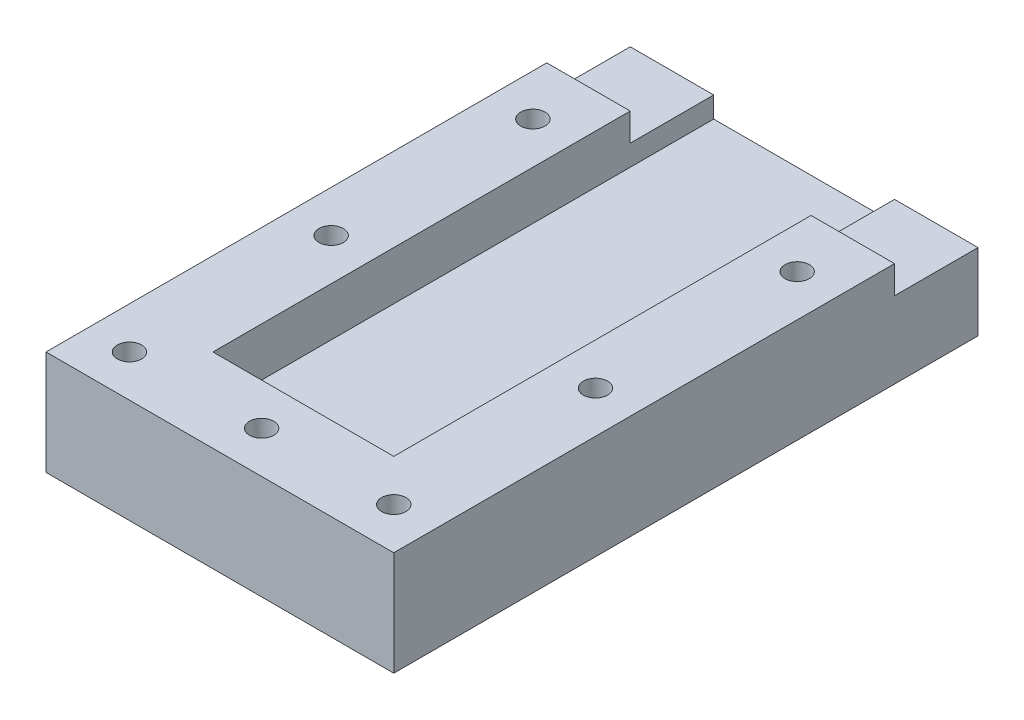
ISO-10303-21;
HEADER;
FILE_DESCRIPTION(('STEP AP214'),'2;1');
FILE_NAME('part.step','',(''),(''),'','','');
FILE_SCHEMA(('AUTOMOTIVE_DESIGN { 1 0 10303 214 1 1 1 1 }'));
ENDSEC;
DATA;
#1=APPLICATION_CONTEXT('core data for automotive mechanical design processes');
#2=APPLICATION_PROTOCOL_DEFINITION('international standard','automotive_design',2000,#1);
#3=PRODUCT_CONTEXT('',#1,'mechanical');
#4=PRODUCT('Part','Part','',(#3));
#5=PRODUCT_RELATED_PRODUCT_CATEGORY('part','',(#4));
#6=PRODUCT_DEFINITION_FORMATION('','',#4);
#7=PRODUCT_DEFINITION_CONTEXT('part definition',#1,'design');
#8=PRODUCT_DEFINITION('design','',#6,#7);
#9=PRODUCT_DEFINITION_SHAPE('','',#8);
#10=(LENGTH_UNIT() NAMED_UNIT(*) SI_UNIT(.MILLI.,.METRE.));
#11=(NAMED_UNIT(*) PLANE_ANGLE_UNIT() SI_UNIT($,.RADIAN.));
#12=(NAMED_UNIT(*) SI_UNIT($,.STERADIAN.) SOLID_ANGLE_UNIT());
#13=UNCERTAINTY_MEASURE_WITH_UNIT(LENGTH_MEASURE(1.E-05),#10,'distance_accuracy_value','');
#14=(GEOMETRIC_REPRESENTATION_CONTEXT(3) GLOBAL_UNCERTAINTY_ASSIGNED_CONTEXT((#13)) GLOBAL_UNIT_ASSIGNED_CONTEXT((#10,
#11,#12)) REPRESENTATION_CONTEXT('',''));
#15=CARTESIAN_POINT('',(0.,0.,0.));
#16=DIRECTION('',(0.,0.,1.));
#17=DIRECTION('',(1.,0.,0.));
#18=AXIS2_PLACEMENT_3D('',#15,#16,#17);
#19=CARTESIAN_POINT('',(0.,0.,0.));
#20=DIRECTION('',(0.,0.,1.));
#21=DIRECTION('',(1.,0.,0.));
#22=AXIS2_PLACEMENT_3D('',#19,#20,#21);
#23=PLANE('',#22);
#24=DIRECTION('',(0.,-1.,0.));
#25=VECTOR('',#24,1.);
#26=CARTESIAN_POINT('',(-25.,15.,0.));
#27=LINE('',#26,#25);
#28=CARTESIAN_POINT('',(-25.,-4.,0.));
#29=VERTEX_POINT('',#28);
#30=CARTESIAN_POINT('',(-25.,-15.,0.));
#31=VERTEX_POINT('',#30);
#32=EDGE_CURVE('E206',#29,#31,#27,.T.);
#33=ORIENTED_EDGE('',*,*,#32,.F.);
#34=DIRECTION('',(1.,0.,0.));
#35=VECTOR('',#34,1.);
#36=CARTESIAN_POINT('',(-25.,-4.,0.));
#37=LINE('',#36,#35);
#38=CARTESIAN_POINT('',(-13.,-4.,0.));
#39=VERTEX_POINT('',#38);
#40=EDGE_CURVE('E157',#29,#39,#37,.T.);
#41=ORIENTED_EDGE('',*,*,#40,.T.);
#42=DIRECTION('',(0.,1.,0.));
#43=VECTOR('',#42,1.);
#44=CARTESIAN_POINT('',(-13.,7.,0.));
#45=LINE('',#44,#43);
#46=CARTESIAN_POINT('',(-13.,-7.,0.));
#47=VERTEX_POINT('',#46);
#48=EDGE_CURVE('E179',#47,#39,#45,.T.);
#49=ORIENTED_EDGE('',*,*,#48,.F.);
#50=DIRECTION('',(-1.,0.,0.));
#51=VECTOR('',#50,1.);
#52=CARTESIAN_POINT('',(-13.,-7.,0.));
#53=LINE('',#52,#51);
#54=CARTESIAN_POINT('',(13.,-7.,0.));
#55=VERTEX_POINT('',#54);
#56=EDGE_CURVE('E187',#55,#47,#53,.T.);
#57=ORIENTED_EDGE('',*,*,#56,.F.);
#58=DIRECTION('',(0.,-1.,0.));
#59=VECTOR('',#58,1.);
#60=CARTESIAN_POINT('',(13.,7.,0.));
#61=LINE('',#60,#59);
#62=CARTESIAN_POINT('',(13.,-4.,0.));
#63=VERTEX_POINT('',#62);
#64=EDGE_CURVE('E174',#63,#55,#61,.T.);
#65=ORIENTED_EDGE('',*,*,#64,.F.);
#66=DIRECTION('',(-1.,0.,0.));
#67=VECTOR('',#66,1.);
#68=CARTESIAN_POINT('',(25.,-4.,0.));
#69=LINE('',#68,#67);
#70=CARTESIAN_POINT('',(25.,-4.,0.));
#71=VERTEX_POINT('',#70);
#72=EDGE_CURVE('E58',#71,#63,#69,.T.);
#73=ORIENTED_EDGE('',*,*,#72,.F.);
#74=DIRECTION('',(0.,1.,0.));
#75=VECTOR('',#74,1.);
#76=CARTESIAN_POINT('',(25.,15.,0.));
#77=LINE('',#76,#75);
#78=CARTESIAN_POINT('',(25.,-15.,0.));
#79=VERTEX_POINT('',#78);
#80=EDGE_CURVE('E194',#79,#71,#77,.T.);
#81=ORIENTED_EDGE('',*,*,#80,.F.);
#82=DIRECTION('',(1.,0.,0.));
#83=VECTOR('',#82,1.);
#84=CARTESIAN_POINT('',(-25.,-15.,0.));
#85=LINE('',#84,#83);
#86=EDGE_CURVE('E200',#31,#79,#85,.T.);
#87=ORIENTED_EDGE('',*,*,#86,.F.);
#88=EDGE_LOOP('',(#33,#41,#49,#57,#65,#73,#81,#87));
#89=FACE_BOUND('',#88,.T.);
#90=ADVANCED_FACE('F34',(#89),#23,.F.);
#91=CARTESIAN_POINT('',(25.,15.,84.));
#92=DIRECTION('',(-1.,0.,0.));
#93=DIRECTION('',(0.,-1.,0.));
#94=AXIS2_PLACEMENT_3D('',#91,#92,#93);
#95=PLANE('',#94);
#96=DIRECTION('',(0.,1.,0.));
#97=VECTOR('',#96,1.);
#98=CARTESIAN_POINT('',(25.,4.,12.));
#99=LINE('',#98,#97);
#100=CARTESIAN_POINT('',(25.,-4.,12.));
#101=VERTEX_POINT('',#100);
#102=CARTESIAN_POINT('',(25.,0.,12.));
#103=VERTEX_POINT('',#102);
#104=EDGE_CURVE('E165',#101,#103,#99,.T.);
#105=ORIENTED_EDGE('',*,*,#104,.T.);
#106=DIRECTION('',(0.,0.,1.));
#107=VECTOR('',#106,1.);
#108=CARTESIAN_POINT('',(25.,0.,84.));
#109=LINE('',#108,#107);
#110=CARTESIAN_POINT('',(25.,0.,84.));
#111=VERTEX_POINT('',#110);
#112=EDGE_CURVE('E440',#103,#111,#109,.T.);
#113=ORIENTED_EDGE('',*,*,#112,.T.);
#114=DIRECTION('',(0.,1.,0.));
#115=VECTOR('',#114,1.);
#116=CARTESIAN_POINT('',(25.,15.,84.));
#117=LINE('',#116,#115);
#118=CARTESIAN_POINT('',(25.,-15.,84.));
#119=VERTEX_POINT('',#118);
#120=EDGE_CURVE('E197',#119,#111,#117,.T.);
#121=ORIENTED_EDGE('',*,*,#120,.F.);
#122=DIRECTION('',(0.,0.,-1.));
#123=VECTOR('',#122,1.);
#124=CARTESIAN_POINT('',(25.,-15.,84.));
#125=LINE('',#124,#123);
#126=EDGE_CURVE('E43',#119,#79,#125,.T.);
#127=ORIENTED_EDGE('',*,*,#126,.T.);
#128=ORIENTED_EDGE('',*,*,#80,.T.);
#129=DIRECTION('',(0.,0.,1.));
#130=VECTOR('',#129,1.);
#131=CARTESIAN_POINT('',(25.,-4.,0.));
#132=LINE('',#131,#130);
#133=EDGE_CURVE('E162',#71,#101,#132,.T.);
#134=ORIENTED_EDGE('',*,*,#133,.T.);
#135=EDGE_LOOP('',(#105,#113,#121,#127,#128,#134));
#136=FACE_BOUND('',#135,.T.);
#137=ADVANCED_FACE('F36',(#136),#95,.F.);
#138=CARTESIAN_POINT('',(-25.,15.,84.));
#139=DIRECTION('',(1.,0.,0.));
#140=DIRECTION('',(0.,0.,-1.));
#141=AXIS2_PLACEMENT_3D('',#138,#139,#140);
#142=PLANE('',#141);
#143=DIRECTION('',(0.,-1.,0.));
#144=VECTOR('',#143,1.);
#145=CARTESIAN_POINT('',(-25.,15.,84.));
#146=LINE('',#145,#144);
#147=CARTESIAN_POINT('',(-25.,0.,84.));
#148=VERTEX_POINT('',#147);
#149=CARTESIAN_POINT('',(-25.,-15.,84.));
#150=VERTEX_POINT('',#149);
#151=EDGE_CURVE('E139',#148,#150,#146,.T.);
#152=ORIENTED_EDGE('',*,*,#151,.F.);
#153=DIRECTION('',(0.,0.,-1.));
#154=VECTOR('',#153,1.);
#155=CARTESIAN_POINT('',(-25.,0.,84.));
#156=LINE('',#155,#154);
#157=CARTESIAN_POINT('',(-25.,0.,12.));
#158=VERTEX_POINT('',#157);
#159=EDGE_CURVE('E125',#148,#158,#156,.T.);
#160=ORIENTED_EDGE('',*,*,#159,.T.);
#161=DIRECTION('',(0.,-1.,0.));
#162=VECTOR('',#161,1.);
#163=CARTESIAN_POINT('',(-25.,4.,12.));
#164=LINE('',#163,#162);
#165=CARTESIAN_POINT('',(-25.,-4.,12.));
#166=VERTEX_POINT('',#165);
#167=EDGE_CURVE('E136',#158,#166,#164,.T.);
#168=ORIENTED_EDGE('',*,*,#167,.T.);
#169=DIRECTION('',(0.,0.,-1.));
#170=VECTOR('',#169,1.);
#171=CARTESIAN_POINT('',(-25.,-4.,0.));
#172=LINE('',#171,#170);
#173=EDGE_CURVE('E146',#166,#29,#172,.T.);
#174=ORIENTED_EDGE('',*,*,#173,.T.);
#175=ORIENTED_EDGE('',*,*,#32,.T.);
#176=DIRECTION('',(0.,0.,-1.));
#177=VECTOR('',#176,1.);
#178=CARTESIAN_POINT('',(-25.,-15.,84.));
#179=LINE('',#178,#177);
#180=EDGE_CURVE('E12',#150,#31,#179,.T.);
#181=ORIENTED_EDGE('',*,*,#180,.F.);
#182=EDGE_LOOP('',(#152,#160,#168,#174,#175,#181));
#183=FACE_BOUND('',#182,.T.);
#184=ADVANCED_FACE('F134',(#183),#142,.F.);
#185=CARTESIAN_POINT('',(-25.,-15.,84.));
#186=DIRECTION('',(0.,1.,0.));
#187=DIRECTION('',(0.,0.,1.));
#188=AXIS2_PLACEMENT_3D('',#185,#186,#187);
#189=PLANE('',#188);
#190=CARTESIAN_POINT('',(19.,-15.,49.));
#191=DIRECTION('',(0.,1.,0.));
#192=DIRECTION('',(0.,0.,1.));
#193=AXIS2_PLACEMENT_3D('',#190,#191,#192);
#194=CIRCLE('',#193,1.75);
#195=CARTESIAN_POINT('',(19.,-15.,50.75));
#196=VERTEX_POINT('',#195);
#197=EDGE_CURVE('E450',#196,#196,#194,.T.);
#198=ORIENTED_EDGE('',*,*,#197,.T.);
#199=EDGE_LOOP('',(#198));
#200=FACE_BOUND('',#199,.T.);
#201=CARTESIAN_POINT('',(19.,-15.,78.));
#202=DIRECTION('',(0.,1.,0.));
#203=DIRECTION('',(0.,0.,1.));
#204=AXIS2_PLACEMENT_3D('',#201,#202,#203);
#205=CIRCLE('',#204,1.75);
#206=CARTESIAN_POINT('',(19.,-15.,79.75));
#207=VERTEX_POINT('',#206);
#208=EDGE_CURVE('E453',#207,#207,#205,.T.);
#209=ORIENTED_EDGE('',*,*,#208,.T.);
#210=EDGE_LOOP('',(#209));
#211=FACE_BOUND('',#210,.T.);
#212=CARTESIAN_POINT('',(0.,-15.,78.));
#213=DIRECTION('',(0.,1.,0.));
#214=DIRECTION('',(0.,0.,1.));
#215=AXIS2_PLACEMENT_3D('',#212,#213,#214);
#216=CIRCLE('',#215,1.75);
#217=CARTESIAN_POINT('',(0.,-15.,79.75));
#218=VERTEX_POINT('',#217);
#219=EDGE_CURVE('E456',#218,#218,#216,.T.);
#220=ORIENTED_EDGE('',*,*,#219,.T.);
#221=EDGE_LOOP('',(#220));
#222=FACE_BOUND('',#221,.T.);
#223=CARTESIAN_POINT('',(-19.,-15.,78.));
#224=DIRECTION('',(0.,1.,0.));
#225=DIRECTION('',(0.,0.,1.));
#226=AXIS2_PLACEMENT_3D('',#223,#224,#225);
#227=CIRCLE('',#226,1.75);
#228=CARTESIAN_POINT('',(-19.,-15.,79.75));
#229=VERTEX_POINT('',#228);
#230=EDGE_CURVE('E447',#229,#229,#227,.T.);
#231=ORIENTED_EDGE('',*,*,#230,.T.);
#232=EDGE_LOOP('',(#231));
#233=FACE_BOUND('',#232,.T.);
#234=CARTESIAN_POINT('',(-19.,-15.,49.));
#235=DIRECTION('',(0.,1.,0.));
#236=DIRECTION('',(0.,0.,1.));
#237=AXIS2_PLACEMENT_3D('',#234,#235,#236);
#238=CIRCLE('',#237,1.75);
#239=CARTESIAN_POINT('',(-19.,-15.,50.75));
#240=VERTEX_POINT('',#239);
#241=EDGE_CURVE('E444',#240,#240,#238,.T.);
#242=ORIENTED_EDGE('',*,*,#241,.T.);
#243=EDGE_LOOP('',(#242));
#244=FACE_BOUND('',#243,.T.);
#245=CARTESIAN_POINT('',(-19.,-15.,20.));
#246=DIRECTION('',(0.,1.,0.));
#247=DIRECTION('',(0.,0.,1.));
#248=AXIS2_PLACEMENT_3D('',#245,#246,#247);
#249=CIRCLE('',#248,1.75);
#250=CARTESIAN_POINT('',(-19.,-15.,21.75));
#251=VERTEX_POINT('',#250);
#252=EDGE_CURVE('E443',#251,#251,#249,.T.);
#253=ORIENTED_EDGE('',*,*,#252,.T.);
#254=EDGE_LOOP('',(#253));
#255=FACE_BOUND('',#254,.T.);
#256=CARTESIAN_POINT('',(19.,-15.,20.));
#257=DIRECTION('',(0.,1.,0.));
#258=DIRECTION('',(0.,0.,1.));
#259=AXIS2_PLACEMENT_3D('',#256,#257,#258);
#260=CIRCLE('',#259,1.75);
#261=CARTESIAN_POINT('',(19.,-15.,21.75));
#262=VERTEX_POINT('',#261);
#263=EDGE_CURVE('E153',#262,#262,#260,.T.);
#264=ORIENTED_EDGE('',*,*,#263,.T.);
#265=EDGE_LOOP('',(#264));
#266=FACE_BOUND('',#265,.T.);
#267=ORIENTED_EDGE('',*,*,#86,.T.);
#268=ORIENTED_EDGE('',*,*,#126,.F.);
#269=DIRECTION('',(1.,0.,0.));
#270=VECTOR('',#269,1.);
#271=CARTESIAN_POINT('',(-25.,-15.,84.));
#272=LINE('',#271,#270);
#273=EDGE_CURVE('E202',#150,#119,#272,.T.);
#274=ORIENTED_EDGE('',*,*,#273,.F.);
#275=ORIENTED_EDGE('',*,*,#180,.T.);
#276=EDGE_LOOP('',(#267,#268,#274,#275));
#277=FACE_BOUND('',#276,.T.);
#278=ADVANCED_FACE('F265',(#200,#211,#222,#233,#244,#255,#266,#277),#189,.F.);
#279=CARTESIAN_POINT('',(0.,0.,84.));
#280=DIRECTION('',(0.,0.,1.));
#281=DIRECTION('',(1.,0.,0.));
#282=AXIS2_PLACEMENT_3D('',#279,#280,#281);
#283=PLANE('',#282);
#284=DIRECTION('',(1.,0.,0.));
#285=VECTOR('',#284,1.);
#286=CARTESIAN_POINT('',(0.,0.,84.));
#287=LINE('',#286,#285);
#288=EDGE_CURVE('E237',#148,#111,#287,.T.);
#289=ORIENTED_EDGE('',*,*,#288,.F.);
#290=ORIENTED_EDGE('',*,*,#151,.T.);
#291=ORIENTED_EDGE('',*,*,#273,.T.);
#292=ORIENTED_EDGE('',*,*,#120,.T.);
#293=EDGE_LOOP('',(#289,#290,#291,#292));
#294=FACE_BOUND('',#293,.T.);
#295=ADVANCED_FACE('F263',(#294),#283,.T.);
#296=CARTESIAN_POINT('',(13.,7.,72.));
#297=DIRECTION('',(1.,0.,0.));
#298=DIRECTION('',(0.,1.,0.));
#299=AXIS2_PLACEMENT_3D('',#296,#297,#298);
#300=PLANE('',#299);
#301=DIRECTION('',(0.,-1.,0.));
#302=VECTOR('',#301,1.);
#303=CARTESIAN_POINT('',(13.,7.,72.));
#304=LINE('',#303,#302);
#305=CARTESIAN_POINT('',(13.,0.,72.));
#306=VERTEX_POINT('',#305);
#307=CARTESIAN_POINT('',(13.,-7.,72.));
#308=VERTEX_POINT('',#307);
#309=EDGE_CURVE('E176',#306,#308,#304,.T.);
#310=ORIENTED_EDGE('',*,*,#309,.F.);
#311=DIRECTION('',(0.,0.,-1.));
#312=VECTOR('',#311,1.);
#313=CARTESIAN_POINT('',(13.,0.,72.));
#314=LINE('',#313,#312);
#315=CARTESIAN_POINT('',(13.,0.,12.));
#316=VERTEX_POINT('',#315);
#317=EDGE_CURVE('E236',#306,#316,#314,.T.);
#318=ORIENTED_EDGE('',*,*,#317,.T.);
#319=DIRECTION('',(0.,1.,0.));
#320=VECTOR('',#319,1.);
#321=CARTESIAN_POINT('',(13.,4.,12.));
#322=LINE('',#321,#320);
#323=CARTESIAN_POINT('',(13.,-4.,12.));
#324=VERTEX_POINT('',#323);
#325=EDGE_CURVE('E166',#324,#316,#322,.T.);
#326=ORIENTED_EDGE('',*,*,#325,.F.);
#327=DIRECTION('',(0.,0.,1.));
#328=VECTOR('',#327,1.);
#329=CARTESIAN_POINT('',(13.,-4.,0.));
#330=LINE('',#329,#328);
#331=EDGE_CURVE('E160',#63,#324,#330,.T.);
#332=ORIENTED_EDGE('',*,*,#331,.F.);
#333=ORIENTED_EDGE('',*,*,#64,.T.);
#334=DIRECTION('',(0.,0.,-1.));
#335=VECTOR('',#334,1.);
#336=CARTESIAN_POINT('',(13.,-7.,72.));
#337=LINE('',#336,#335);
#338=EDGE_CURVE('E185',#308,#55,#337,.T.);
#339=ORIENTED_EDGE('',*,*,#338,.F.);
#340=EDGE_LOOP('',(#310,#318,#326,#332,#333,#339));
#341=FACE_BOUND('',#340,.T.);
#342=ADVANCED_FACE('F226',(#341),#300,.F.);
#343=CARTESIAN_POINT('',(-13.,7.,72.));
#344=DIRECTION('',(-1.,0.,0.));
#345=DIRECTION('',(0.,-1.,0.));
#346=AXIS2_PLACEMENT_3D('',#343,#344,#345);
#347=PLANE('',#346);
#348=DIRECTION('',(0.,-1.,0.));
#349=VECTOR('',#348,1.);
#350=CARTESIAN_POINT('',(-13.,4.,12.));
#351=LINE('',#350,#349);
#352=CARTESIAN_POINT('',(-13.,0.,12.));
#353=VERTEX_POINT('',#352);
#354=CARTESIAN_POINT('',(-13.,-4.,12.));
#355=VERTEX_POINT('',#354);
#356=EDGE_CURVE('E150',#353,#355,#351,.T.);
#357=ORIENTED_EDGE('',*,*,#356,.F.);
#358=DIRECTION('',(0.,0.,1.));
#359=VECTOR('',#358,1.);
#360=CARTESIAN_POINT('',(-13.,0.,72.));
#361=LINE('',#360,#359);
#362=CARTESIAN_POINT('',(-13.,0.,72.));
#363=VERTEX_POINT('',#362);
#364=EDGE_CURVE('E50',#353,#363,#361,.T.);
#365=ORIENTED_EDGE('',*,*,#364,.T.);
#366=DIRECTION('',(0.,1.,0.));
#367=VECTOR('',#366,1.);
#368=CARTESIAN_POINT('',(-13.,7.,72.));
#369=LINE('',#368,#367);
#370=CARTESIAN_POINT('',(-13.,-7.,72.));
#371=VERTEX_POINT('',#370);
#372=EDGE_CURVE('E182',#371,#363,#369,.T.);
#373=ORIENTED_EDGE('',*,*,#372,.F.);
#374=DIRECTION('',(0.,0.,-1.));
#375=VECTOR('',#374,1.);
#376=CARTESIAN_POINT('',(-13.,-7.,72.));
#377=LINE('',#376,#375);
#378=EDGE_CURVE('E192',#371,#47,#377,.T.);
#379=ORIENTED_EDGE('',*,*,#378,.T.);
#380=ORIENTED_EDGE('',*,*,#48,.T.);
#381=DIRECTION('',(0.,0.,-1.));
#382=VECTOR('',#381,1.);
#383=CARTESIAN_POINT('',(-13.,-4.,0.));
#384=LINE('',#383,#382);
#385=EDGE_CURVE('E147',#355,#39,#384,.T.);
#386=ORIENTED_EDGE('',*,*,#385,.F.);
#387=EDGE_LOOP('',(#357,#365,#373,#379,#380,#386));
#388=FACE_BOUND('',#387,.T.);
#389=ADVANCED_FACE('F290',(#388),#347,.F.);
#390=CARTESIAN_POINT('',(-13.,-7.,72.));
#391=DIRECTION('',(0.,-1.,0.));
#392=DIRECTION('',(1.,0.,0.));
#393=AXIS2_PLACEMENT_3D('',#390,#391,#392);
#394=PLANE('',#393);
#395=ORIENTED_EDGE('',*,*,#56,.T.);
#396=ORIENTED_EDGE('',*,*,#378,.F.);
#397=DIRECTION('',(-1.,0.,0.));
#398=VECTOR('',#397,1.);
#399=CARTESIAN_POINT('',(-13.,-7.,72.));
#400=LINE('',#399,#398);
#401=EDGE_CURVE('E178',#308,#371,#400,.T.);
#402=ORIENTED_EDGE('',*,*,#401,.F.);
#403=ORIENTED_EDGE('',*,*,#338,.T.);
#404=EDGE_LOOP('',(#395,#396,#402,#403));
#405=FACE_BOUND('',#404,.T.);
#406=ADVANCED_FACE('F230',(#405),#394,.F.);
#407=CARTESIAN_POINT('',(0.,0.,72.));
#408=DIRECTION('',(0.,0.,1.));
#409=DIRECTION('',(1.,0.,0.));
#410=AXIS2_PLACEMENT_3D('',#407,#408,#409);
#411=PLANE('',#410);
#412=ORIENTED_EDGE('',*,*,#372,.T.);
#413=DIRECTION('',(1.,0.,0.));
#414=VECTOR('',#413,1.);
#415=CARTESIAN_POINT('',(0.,0.,72.));
#416=LINE('',#415,#414);
#417=EDGE_CURVE('E140',#363,#306,#416,.T.);
#418=ORIENTED_EDGE('',*,*,#417,.T.);
#419=ORIENTED_EDGE('',*,*,#309,.T.);
#420=ORIENTED_EDGE('',*,*,#401,.T.);
#421=EDGE_LOOP('',(#412,#418,#419,#420));
#422=FACE_BOUND('',#421,.T.);
#423=ADVANCED_FACE('F233',(#422),#411,.F.);
#424=CARTESIAN_POINT('',(25.,4.,12.));
#425=DIRECTION('',(0.,0.,1.));
#426=DIRECTION('',(0.,-1.,0.));
#427=AXIS2_PLACEMENT_3D('',#424,#425,#426);
#428=PLANE('',#427);
#429=ORIENTED_EDGE('',*,*,#325,.T.);
#430=DIRECTION('',(1.,0.,0.));
#431=VECTOR('',#430,1.);
#432=CARTESIAN_POINT('',(25.,0.,12.));
#433=LINE('',#432,#431);
#434=EDGE_CURVE('E243',#316,#103,#433,.T.);
#435=ORIENTED_EDGE('',*,*,#434,.T.);
#436=ORIENTED_EDGE('',*,*,#104,.F.);
#437=DIRECTION('',(-1.,0.,0.));
#438=VECTOR('',#437,1.);
#439=CARTESIAN_POINT('',(25.,-4.,12.));
#440=LINE('',#439,#438);
#441=EDGE_CURVE('E172',#101,#324,#440,.T.);
#442=ORIENTED_EDGE('',*,*,#441,.T.);
#443=EDGE_LOOP('',(#429,#435,#436,#442));
#444=FACE_BOUND('',#443,.T.);
#445=ADVANCED_FACE('F241',(#444),#428,.F.);
#446=CARTESIAN_POINT('',(25.,-4.,0.));
#447=DIRECTION('',(0.,-1.,0.));
#448=DIRECTION('',(1.,0.,0.));
#449=AXIS2_PLACEMENT_3D('',#446,#447,#448);
#450=PLANE('',#449);
#451=ORIENTED_EDGE('',*,*,#331,.T.);
#452=ORIENTED_EDGE('',*,*,#441,.F.);
#453=ORIENTED_EDGE('',*,*,#133,.F.);
#454=ORIENTED_EDGE('',*,*,#72,.T.);
#455=EDGE_LOOP('',(#451,#452,#453,#454));
#456=FACE_BOUND('',#455,.T.);
#457=ADVANCED_FACE('F244',(#456),#450,.F.);
#458=CARTESIAN_POINT('',(-25.,-4.,0.));
#459=DIRECTION('',(0.,-1.,0.));
#460=DIRECTION('',(1.,0.,0.));
#461=AXIS2_PLACEMENT_3D('',#458,#459,#460);
#462=PLANE('',#461);
#463=ORIENTED_EDGE('',*,*,#385,.T.);
#464=ORIENTED_EDGE('',*,*,#40,.F.);
#465=ORIENTED_EDGE('',*,*,#173,.F.);
#466=DIRECTION('',(1.,0.,0.));
#467=VECTOR('',#466,1.);
#468=CARTESIAN_POINT('',(-25.,-4.,12.));
#469=LINE('',#468,#467);
#470=EDGE_CURVE('E144',#166,#355,#469,.T.);
#471=ORIENTED_EDGE('',*,*,#470,.T.);
#472=EDGE_LOOP('',(#463,#464,#465,#471));
#473=FACE_BOUND('',#472,.T.);
#474=ADVANCED_FACE('F246',(#473),#462,.F.);
#475=CARTESIAN_POINT('',(-25.,4.,12.));
#476=DIRECTION('',(0.,0.,1.));
#477=DIRECTION('',(1.,0.,0.));
#478=AXIS2_PLACEMENT_3D('',#475,#476,#477);
#479=PLANE('',#478);
#480=ORIENTED_EDGE('',*,*,#167,.F.);
#481=DIRECTION('',(1.,0.,0.));
#482=VECTOR('',#481,1.);
#483=CARTESIAN_POINT('',(-25.,0.,12.));
#484=LINE('',#483,#482);
#485=EDGE_CURVE('E122',#158,#353,#484,.T.);
#486=ORIENTED_EDGE('',*,*,#485,.T.);
#487=ORIENTED_EDGE('',*,*,#356,.T.);
#488=ORIENTED_EDGE('',*,*,#470,.F.);
#489=EDGE_LOOP('',(#480,#486,#487,#488));
#490=FACE_BOUND('',#489,.T.);
#491=ADVANCED_FACE('F142',(#490),#479,.F.);
#492=CARTESIAN_POINT('',(19.,-15.,20.));
#493=DIRECTION('',(0.,1.,0.));
#494=DIRECTION('',(0.,0.,1.));
#495=AXIS2_PLACEMENT_3D('',#492,#493,#494);
#496=CYLINDRICAL_SURFACE('',#495,1.75);
#497=CARTESIAN_POINT('',(19.,0.,20.));
#498=DIRECTION('',(0.,-1.,0.));
#499=DIRECTION('',(0.,0.,-1.));
#500=AXIS2_PLACEMENT_3D('',#497,#498,#499);
#501=CIRCLE('',#500,1.75);
#502=CARTESIAN_POINT('',(19.,0.,18.25));
#503=VERTEX_POINT('',#502);
#504=EDGE_CURVE('E130',#503,#503,#501,.F.);
#505=ORIENTED_EDGE('',*,*,#504,.T.);
#506=EDGE_LOOP('',(#505));
#507=FACE_BOUND('',#506,.T.);
#508=ORIENTED_EDGE('',*,*,#263,.F.);
#509=EDGE_LOOP('',(#508));
#510=FACE_BOUND('',#509,.T.);
#511=ADVANCED_FACE('F322',(#507,#510),#496,.F.);
#512=CARTESIAN_POINT('',(-19.,-15.,20.));
#513=DIRECTION('',(0.,1.,0.));
#514=DIRECTION('',(0.,0.,1.));
#515=AXIS2_PLACEMENT_3D('',#512,#513,#514);
#516=CYLINDRICAL_SURFACE('',#515,1.75);
#517=CARTESIAN_POINT('',(-19.,0.,20.));
#518=DIRECTION('',(0.,-1.,0.));
#519=DIRECTION('',(0.,0.,-1.));
#520=AXIS2_PLACEMENT_3D('',#517,#518,#519);
#521=CIRCLE('',#520,1.75);
#522=CARTESIAN_POINT('',(-19.,0.,18.25));
#523=VERTEX_POINT('',#522);
#524=EDGE_CURVE('E411',#523,#523,#521,.F.);
#525=ORIENTED_EDGE('',*,*,#524,.T.);
#526=EDGE_LOOP('',(#525));
#527=FACE_BOUND('',#526,.T.);
#528=ORIENTED_EDGE('',*,*,#252,.F.);
#529=EDGE_LOOP('',(#528));
#530=FACE_BOUND('',#529,.T.);
#531=ADVANCED_FACE('F332',(#527,#530),#516,.F.);
#532=CARTESIAN_POINT('',(-19.,-15.,49.));
#533=DIRECTION('',(0.,1.,0.));
#534=DIRECTION('',(0.,0.,1.));
#535=AXIS2_PLACEMENT_3D('',#532,#533,#534);
#536=CYLINDRICAL_SURFACE('',#535,1.75);
#537=CARTESIAN_POINT('',(-19.,0.,49.));
#538=DIRECTION('',(0.,-1.,0.));
#539=DIRECTION('',(0.,0.,-1.));
#540=AXIS2_PLACEMENT_3D('',#537,#538,#539);
#541=CIRCLE('',#540,1.75);
#542=CARTESIAN_POINT('',(-19.,0.,47.25));
#543=VERTEX_POINT('',#542);
#544=EDGE_CURVE('E415',#543,#543,#541,.F.);
#545=ORIENTED_EDGE('',*,*,#544,.T.);
#546=EDGE_LOOP('',(#545));
#547=FACE_BOUND('',#546,.T.);
#548=ORIENTED_EDGE('',*,*,#241,.F.);
#549=EDGE_LOOP('',(#548));
#550=FACE_BOUND('',#549,.T.);
#551=ADVANCED_FACE('F342',(#547,#550),#536,.F.);
#552=CARTESIAN_POINT('',(-19.,-15.,78.));
#553=DIRECTION('',(0.,1.,0.));
#554=DIRECTION('',(0.,0.,1.));
#555=AXIS2_PLACEMENT_3D('',#552,#553,#554);
#556=CYLINDRICAL_SURFACE('',#555,1.75);
#557=CARTESIAN_POINT('',(-19.,0.,78.));
#558=DIRECTION('',(0.,-1.,0.));
#559=DIRECTION('',(0.,0.,-1.));
#560=AXIS2_PLACEMENT_3D('',#557,#558,#559);
#561=CIRCLE('',#560,1.75);
#562=CARTESIAN_POINT('',(-19.,0.,76.25));
#563=VERTEX_POINT('',#562);
#564=EDGE_CURVE('E419',#563,#563,#561,.F.);
#565=ORIENTED_EDGE('',*,*,#564,.T.);
#566=EDGE_LOOP('',(#565));
#567=FACE_BOUND('',#566,.T.);
#568=ORIENTED_EDGE('',*,*,#230,.F.);
#569=EDGE_LOOP('',(#568));
#570=FACE_BOUND('',#569,.T.);
#571=ADVANCED_FACE('F352',(#567,#570),#556,.F.);
#572=CARTESIAN_POINT('',(0.,-15.,78.));
#573=DIRECTION('',(0.,1.,0.));
#574=DIRECTION('',(0.,0.,1.));
#575=AXIS2_PLACEMENT_3D('',#572,#573,#574);
#576=CYLINDRICAL_SURFACE('',#575,1.75);
#577=CARTESIAN_POINT('',(0.,0.,78.));
#578=DIRECTION('',(0.,-1.,0.));
#579=DIRECTION('',(0.,0.,-1.));
#580=AXIS2_PLACEMENT_3D('',#577,#578,#579);
#581=CIRCLE('',#580,1.75);
#582=CARTESIAN_POINT('',(0.,0.,76.25));
#583=VERTEX_POINT('',#582);
#584=EDGE_CURVE('E423',#583,#583,#581,.F.);
#585=ORIENTED_EDGE('',*,*,#584,.T.);
#586=EDGE_LOOP('',(#585));
#587=FACE_BOUND('',#586,.T.);
#588=ORIENTED_EDGE('',*,*,#219,.F.);
#589=EDGE_LOOP('',(#588));
#590=FACE_BOUND('',#589,.T.);
#591=ADVANCED_FACE('F362',(#587,#590),#576,.F.);
#592=CARTESIAN_POINT('',(19.,-15.,78.));
#593=DIRECTION('',(0.,1.,0.));
#594=DIRECTION('',(0.,0.,1.));
#595=AXIS2_PLACEMENT_3D('',#592,#593,#594);
#596=CYLINDRICAL_SURFACE('',#595,1.75);
#597=CARTESIAN_POINT('',(19.,0.,78.));
#598=DIRECTION('',(0.,-1.,0.));
#599=DIRECTION('',(0.,0.,-1.));
#600=AXIS2_PLACEMENT_3D('',#597,#598,#599);
#601=CIRCLE('',#600,1.75);
#602=CARTESIAN_POINT('',(19.,0.,76.25));
#603=VERTEX_POINT('',#602);
#604=EDGE_CURVE('E427',#603,#603,#601,.F.);
#605=ORIENTED_EDGE('',*,*,#604,.T.);
#606=EDGE_LOOP('',(#605));
#607=FACE_BOUND('',#606,.T.);
#608=ORIENTED_EDGE('',*,*,#208,.F.);
#609=EDGE_LOOP('',(#608));
#610=FACE_BOUND('',#609,.T.);
#611=ADVANCED_FACE('F372',(#607,#610),#596,.F.);
#612=CARTESIAN_POINT('',(19.,-15.,49.));
#613=DIRECTION('',(0.,1.,0.));
#614=DIRECTION('',(0.,0.,1.));
#615=AXIS2_PLACEMENT_3D('',#612,#613,#614);
#616=CYLINDRICAL_SURFACE('',#615,1.75);
#617=CARTESIAN_POINT('',(19.,0.,49.));
#618=DIRECTION('',(0.,-1.,0.));
#619=DIRECTION('',(0.,0.,-1.));
#620=AXIS2_PLACEMENT_3D('',#617,#618,#619);
#621=CIRCLE('',#620,1.75);
#622=CARTESIAN_POINT('',(19.,0.,47.25));
#623=VERTEX_POINT('',#622);
#624=EDGE_CURVE('E38',#623,#623,#621,.F.);
#625=ORIENTED_EDGE('',*,*,#624,.T.);
#626=EDGE_LOOP('',(#625));
#627=FACE_BOUND('',#626,.T.);
#628=ORIENTED_EDGE('',*,*,#197,.F.);
#629=EDGE_LOOP('',(#628));
#630=FACE_BOUND('',#629,.T.);
#631=ADVANCED_FACE('F382',(#627,#630),#616,.F.);
#632=CARTESIAN_POINT('',(0.,0.,0.));
#633=DIRECTION('',(0.,-1.,0.));
#634=DIRECTION('',(0.,0.,-1.));
#635=AXIS2_PLACEMENT_3D('',#632,#633,#634);
#636=PLANE('',#635);
#637=ORIENTED_EDGE('',*,*,#504,.F.);
#638=EDGE_LOOP('',(#637));
#639=FACE_BOUND('',#638,.T.);
#640=ORIENTED_EDGE('',*,*,#524,.F.);
#641=EDGE_LOOP('',(#640));
#642=FACE_BOUND('',#641,.T.);
#643=ORIENTED_EDGE('',*,*,#544,.F.);
#644=EDGE_LOOP('',(#643));
#645=FACE_BOUND('',#644,.T.);
#646=ORIENTED_EDGE('',*,*,#564,.F.);
#647=EDGE_LOOP('',(#646));
#648=FACE_BOUND('',#647,.T.);
#649=ORIENTED_EDGE('',*,*,#584,.F.);
#650=EDGE_LOOP('',(#649));
#651=FACE_BOUND('',#650,.T.);
#652=ORIENTED_EDGE('',*,*,#604,.F.);
#653=EDGE_LOOP('',(#652));
#654=FACE_BOUND('',#653,.T.);
#655=ORIENTED_EDGE('',*,*,#624,.F.);
#656=EDGE_LOOP('',(#655));
#657=FACE_BOUND('',#656,.T.);
#658=ORIENTED_EDGE('',*,*,#434,.F.);
#659=ORIENTED_EDGE('',*,*,#317,.F.);
#660=ORIENTED_EDGE('',*,*,#417,.F.);
#661=ORIENTED_EDGE('',*,*,#364,.F.);
#662=ORIENTED_EDGE('',*,*,#485,.F.);
#663=ORIENTED_EDGE('',*,*,#159,.F.);
#664=ORIENTED_EDGE('',*,*,#288,.T.);
#665=ORIENTED_EDGE('',*,*,#112,.F.);
#666=EDGE_LOOP('',(#658,#659,#660,#661,#662,#663,#664,#665));
#667=FACE_BOUND('',#666,.T.);
#668=ADVANCED_FACE('F124',(#639,#642,#645,#648,#651,#654,#657,#667),#636,.F.);
#669=CLOSED_SHELL('',(#90,#137,#184,#278,#295,#342,#389,#406,#423,#445,#457,#474,#491,#511,#531,
#551,#571,#591,#611,#631,#668));
#670=MANIFOLD_SOLID_BREP('B2',#669);
#671=ADVANCED_BREP_SHAPE_REPRESENTATION('',(#18,#670),#14);
#672=SHAPE_DEFINITION_REPRESENTATION(#9,#671);
ENDSEC;
END-ISO-10303-21;
